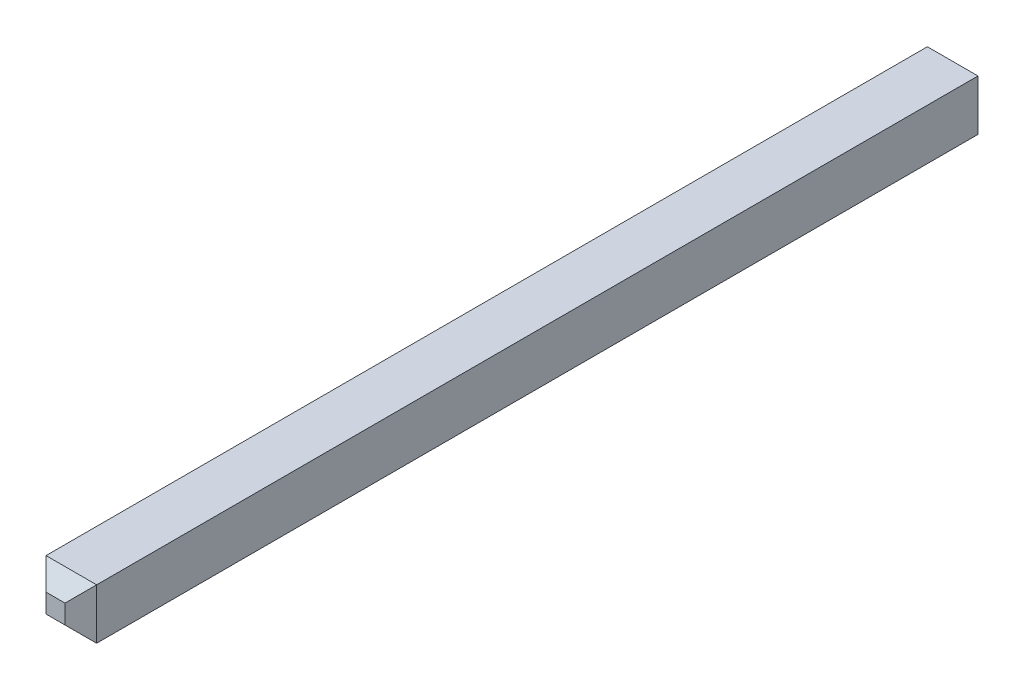
ISO-10303-21;
HEADER;
FILE_DESCRIPTION(('STEP AP214'),'2;1');
FILE_NAME('part.step','',(''),(''),'','','');
FILE_SCHEMA(('AUTOMOTIVE_DESIGN { 1 0 10303 214 1 1 1 1 }'));
ENDSEC;
DATA;
#1=APPLICATION_CONTEXT('core data for automotive mechanical design processes');
#2=APPLICATION_PROTOCOL_DEFINITION('international standard','automotive_design',2000,#1);
#3=PRODUCT_CONTEXT('',#1,'mechanical');
#4=PRODUCT('Part','Part','',(#3));
#5=PRODUCT_RELATED_PRODUCT_CATEGORY('part','',(#4));
#6=PRODUCT_DEFINITION_FORMATION('','',#4);
#7=PRODUCT_DEFINITION_CONTEXT('part definition',#1,'design');
#8=PRODUCT_DEFINITION('design','',#6,#7);
#9=PRODUCT_DEFINITION_SHAPE('','',#8);
#10=(LENGTH_UNIT() NAMED_UNIT(*) SI_UNIT(.MILLI.,.METRE.));
#11=(NAMED_UNIT(*) PLANE_ANGLE_UNIT() SI_UNIT($,.RADIAN.));
#12=(NAMED_UNIT(*) SI_UNIT($,.STERADIAN.) SOLID_ANGLE_UNIT());
#13=UNCERTAINTY_MEASURE_WITH_UNIT(LENGTH_MEASURE(1.E-05),#10,'distance_accuracy_value','');
#14=(GEOMETRIC_REPRESENTATION_CONTEXT(3) GLOBAL_UNCERTAINTY_ASSIGNED_CONTEXT((#13)) GLOBAL_UNIT_ASSIGNED_CONTEXT((#10,
#11,#12)) REPRESENTATION_CONTEXT('',''));
#15=CARTESIAN_POINT('',(0.,0.,0.));
#16=DIRECTION('',(0.,0.,1.));
#17=DIRECTION('',(1.,0.,0.));
#18=AXIS2_PLACEMENT_3D('',#15,#16,#17);
#19=CARTESIAN_POINT('',(-0.32,0.12,-5.77));
#20=DIRECTION('',(0.,-0.707106781186548,0.707106781186548));
#21=DIRECTION('',(0.,-0.707106781186548,-0.707106781186548));
#22=AXIS2_PLACEMENT_3D('',#19,#20,#21);
#23=PLANE('',#22);
#24=DIRECTION('',(1.,0.,0.));
#25=VECTOR('',#24,1.);
#26=CARTESIAN_POINT('',(-0.32,0.12,-5.77));
#27=LINE('',#26,#25);
#28=CARTESIAN_POINT('',(0.12,0.12,-5.77));
#29=VERTEX_POINT('',#28);
#30=CARTESIAN_POINT('',(-0.12,0.12,-5.77));
#31=VERTEX_POINT('',#30);
#32=EDGE_CURVE('E79',#29,#31,#27,.F.);
#33=ORIENTED_EDGE('',*,*,#32,.T.);
#34=DIRECTION('',(-0.577350269189626,0.577350269189626,0.577350269189625));
#35=VECTOR('',#34,1.);
#36=CARTESIAN_POINT('',(-0.12,0.12,-5.77));
#37=LINE('',#36,#35);
#38=CARTESIAN_POINT('',(-0.32,0.32,-5.57));
#39=VERTEX_POINT('',#38);
#40=EDGE_CURVE('E20',#31,#39,#37,.T.);
#41=ORIENTED_EDGE('',*,*,#40,.T.);
#42=DIRECTION('',(1.,0.,0.));
#43=VECTOR('',#42,1.);
#44=CARTESIAN_POINT('',(0.,0.32,-5.57));
#45=LINE('',#44,#43);
#46=CARTESIAN_POINT('',(0.32,0.319999999999999,-5.57));
#47=VERTEX_POINT('',#46);
#48=EDGE_CURVE('E100',#39,#47,#45,.T.);
#49=ORIENTED_EDGE('',*,*,#48,.T.);
#50=DIRECTION('',(-0.577350269189626,-0.577350269189626,-0.577350269189625));
#51=VECTOR('',#50,1.);
#52=CARTESIAN_POINT('',(0.32,0.32,-5.57));
#53=LINE('',#52,#51);
#54=EDGE_CURVE('E85',#47,#29,#53,.T.);
#55=ORIENTED_EDGE('',*,*,#54,.T.);
#56=EDGE_LOOP('',(#33,#41,#49,#55));
#57=FACE_BOUND('',#56,.T.);
#58=ADVANCED_FACE('F17',(#57),#23,.F.);
#59=CARTESIAN_POINT('',(0.32,0.12,5.77));
#60=DIRECTION('',(0.,-0.707106781186548,-0.707106781186548));
#61=DIRECTION('',(0.,0.707106781186548,-0.707106781186548));
#62=AXIS2_PLACEMENT_3D('',#59,#60,#61);
#63=PLANE('',#62);
#64=DIRECTION('',(1.,0.,0.));
#65=VECTOR('',#64,1.);
#66=CARTESIAN_POINT('',(0.,0.32,5.57));
#67=LINE('',#66,#65);
#68=CARTESIAN_POINT('',(0.32,0.32,5.57));
#69=VERTEX_POINT('',#68);
#70=CARTESIAN_POINT('',(-0.32,0.32,5.57));
#71=VERTEX_POINT('',#70);
#72=EDGE_CURVE('E98',#69,#71,#67,.F.);
#73=ORIENTED_EDGE('',*,*,#72,.T.);
#74=DIRECTION('',(0.577350269189626,-0.577350269189626,0.577350269189625));
#75=VECTOR('',#74,1.);
#76=CARTESIAN_POINT('',(-0.32,0.32,5.57));
#77=LINE('',#76,#75);
#78=CARTESIAN_POINT('',(-0.12,0.12,5.77));
#79=VERTEX_POINT('',#78);
#80=EDGE_CURVE('E107',#71,#79,#77,.T.);
#81=ORIENTED_EDGE('',*,*,#80,.T.);
#82=DIRECTION('',(-1.,0.,0.));
#83=VECTOR('',#82,1.);
#84=CARTESIAN_POINT('',(0.32,0.12,5.77));
#85=LINE('',#84,#83);
#86=CARTESIAN_POINT('',(0.12,0.12,5.77));
#87=VERTEX_POINT('',#86);
#88=EDGE_CURVE('E114',#79,#87,#85,.F.);
#89=ORIENTED_EDGE('',*,*,#88,.T.);
#90=DIRECTION('',(0.577350269189626,0.577350269189626,-0.577350269189625));
#91=VECTOR('',#90,1.);
#92=CARTESIAN_POINT('',(0.12,0.12,5.77));
#93=LINE('',#92,#91);
#94=EDGE_CURVE('E109',#87,#69,#93,.T.);
#95=ORIENTED_EDGE('',*,*,#94,.T.);
#96=EDGE_LOOP('',(#73,#81,#89,#95));
#97=FACE_BOUND('',#96,.T.);
#98=ADVANCED_FACE('F176',(#97),#63,.F.);
#99=CARTESIAN_POINT('',(-0.12,-0.32,-5.77));
#100=DIRECTION('',(0.707106781186548,0.,0.707106781186548));
#101=DIRECTION('',(0.707106781186548,0.,-0.707106781186548));
#102=AXIS2_PLACEMENT_3D('',#99,#100,#101);
#103=PLANE('',#102);
#104=DIRECTION('',(0.,1.,0.));
#105=VECTOR('',#104,1.);
#106=CARTESIAN_POINT('',(-0.12,-0.32,-5.77));
#107=LINE('',#106,#105);
#108=CARTESIAN_POINT('',(-0.12,-0.12,-5.77));
#109=VERTEX_POINT('',#108);
#110=EDGE_CURVE('E87',#31,#109,#107,.F.);
#111=ORIENTED_EDGE('',*,*,#110,.T.);
#112=DIRECTION('',(0.577350269189625,0.577350269189628,-0.577350269189624));
#113=VECTOR('',#112,1.);
#114=CARTESIAN_POINT('',(-0.32,-0.320000000000002,-5.57));
#115=LINE('',#114,#113);
#116=CARTESIAN_POINT('',(-0.32,-0.32,-5.57));
#117=VERTEX_POINT('',#116);
#118=EDGE_CURVE('E124',#117,#109,#115,.T.);
#119=ORIENTED_EDGE('',*,*,#118,.F.);
#120=DIRECTION('',(0.,1.,0.));
#121=VECTOR('',#120,1.);
#122=CARTESIAN_POINT('',(-0.320000000000001,-0.32,-5.57));
#123=LINE('',#122,#121);
#124=EDGE_CURVE('E92',#117,#39,#123,.T.);
#125=ORIENTED_EDGE('',*,*,#124,.T.);
#126=ORIENTED_EDGE('',*,*,#40,.F.);
#127=EDGE_LOOP('',(#111,#119,#125,#126));
#128=FACE_BOUND('',#127,.T.);
#129=ADVANCED_FACE('F89',(#128),#103,.F.);
#130=CARTESIAN_POINT('',(-0.32,-0.32,-5.77));
#131=DIRECTION('',(0.,0.,1.));
#132=DIRECTION('',(1.,0.,0.));
#133=AXIS2_PLACEMENT_3D('',#130,#131,#132);
#134=PLANE('',#133);
#135=DIRECTION('',(1.,0.,0.));
#136=VECTOR('',#135,1.);
#137=CARTESIAN_POINT('',(0.,-0.12,-5.77));
#138=LINE('',#137,#136);
#139=CARTESIAN_POINT('',(0.12,-0.12,-5.77));
#140=VERTEX_POINT('',#139);
#141=EDGE_CURVE('E96',#109,#140,#138,.T.);
#142=ORIENTED_EDGE('',*,*,#141,.F.);
#143=ORIENTED_EDGE('',*,*,#110,.F.);
#144=ORIENTED_EDGE('',*,*,#32,.F.);
#145=DIRECTION('',(0.,1.,0.));
#146=VECTOR('',#145,1.);
#147=CARTESIAN_POINT('',(0.12,-0.32,-5.77));
#148=LINE('',#147,#146);
#149=EDGE_CURVE('E104',#29,#140,#148,.F.);
#150=ORIENTED_EDGE('',*,*,#149,.T.);
#151=EDGE_LOOP('',(#142,#143,#144,#150));
#152=FACE_BOUND('',#151,.T.);
#153=ADVANCED_FACE('F94',(#152),#134,.F.);
#154=CARTESIAN_POINT('',(0.,0.32,0.));
#155=DIRECTION('',(0.,-1.,0.));
#156=DIRECTION('',(0.,0.,-1.));
#157=AXIS2_PLACEMENT_3D('',#154,#155,#156);
#158=PLANE('',#157);
#159=ORIENTED_EDGE('',*,*,#48,.F.);
#160=DIRECTION('',(0.,0.,-1.));
#161=VECTOR('',#160,1.);
#162=CARTESIAN_POINT('',(-0.32,0.32,5.77));
#163=LINE('',#162,#161);
#164=EDGE_CURVE('E121',#39,#71,#163,.F.);
#165=ORIENTED_EDGE('',*,*,#164,.T.);
#166=ORIENTED_EDGE('',*,*,#72,.F.);
#167=DIRECTION('',(0.,0.,1.));
#168=VECTOR('',#167,1.);
#169=CARTESIAN_POINT('',(0.32,0.32,-5.77));
#170=LINE('',#169,#168);
#171=EDGE_CURVE('E132',#69,#47,#170,.F.);
#172=ORIENTED_EDGE('',*,*,#171,.T.);
#173=EDGE_LOOP('',(#159,#165,#166,#172));
#174=FACE_BOUND('',#173,.T.);
#175=ADVANCED_FACE('F210',(#174),#158,.F.);
#176=CARTESIAN_POINT('',(0.32,-0.32,-5.57));
#177=DIRECTION('',(-0.707106781186548,0.,0.707106781186548));
#178=DIRECTION('',(0.707106781186548,0.,0.707106781186548));
#179=AXIS2_PLACEMENT_3D('',#176,#177,#178);
#180=PLANE('',#179);
#181=DIRECTION('',(0.,1.,0.));
#182=VECTOR('',#181,1.);
#183=CARTESIAN_POINT('',(0.32,-0.32,-5.57));
#184=LINE('',#183,#182);
#185=CARTESIAN_POINT('',(0.32,-0.32,-5.57));
#186=VERTEX_POINT('',#185);
#187=EDGE_CURVE('E135',#47,#186,#184,.F.);
#188=ORIENTED_EDGE('',*,*,#187,.T.);
#189=DIRECTION('',(0.577350269189627,-0.577350269189624,0.577350269189626));
#190=VECTOR('',#189,1.);
#191=CARTESIAN_POINT('',(0.12,-0.12,-5.77));
#192=LINE('',#191,#190);
#193=EDGE_CURVE('E127',#140,#186,#192,.T.);
#194=ORIENTED_EDGE('',*,*,#193,.F.);
#195=ORIENTED_EDGE('',*,*,#149,.F.);
#196=ORIENTED_EDGE('',*,*,#54,.F.);
#197=EDGE_LOOP('',(#188,#194,#195,#196));
#198=FACE_BOUND('',#197,.T.);
#199=ADVANCED_FACE('F187',(#198),#180,.F.);
#200=CARTESIAN_POINT('',(-0.32,-0.32,5.57));
#201=DIRECTION('',(0.707106781186548,0.,-0.707106781186548));
#202=DIRECTION('',(-0.707106781186548,0.,-0.707106781186548));
#203=AXIS2_PLACEMENT_3D('',#200,#201,#202);
#204=PLANE('',#203);
#205=DIRECTION('',(0.,1.,0.));
#206=VECTOR('',#205,1.);
#207=CARTESIAN_POINT('',(-0.12,-0.32,5.77));
#208=LINE('',#207,#206);
#209=CARTESIAN_POINT('',(-0.12,-0.12,5.77));
#210=VERTEX_POINT('',#209);
#211=EDGE_CURVE('E111',#210,#79,#208,.T.);
#212=ORIENTED_EDGE('',*,*,#211,.T.);
#213=ORIENTED_EDGE('',*,*,#80,.F.);
#214=DIRECTION('',(0.,1.,0.));
#215=VECTOR('',#214,1.);
#216=CARTESIAN_POINT('',(-0.32,-0.32,5.57));
#217=LINE('',#216,#215);
#218=CARTESIAN_POINT('',(-0.32,-0.32,5.57));
#219=VERTEX_POINT('',#218);
#220=EDGE_CURVE('E118',#71,#219,#217,.F.);
#221=ORIENTED_EDGE('',*,*,#220,.T.);
#222=DIRECTION('',(-0.577350269189627,-0.577350269189626,-0.577350269189625));
#223=VECTOR('',#222,1.);
#224=CARTESIAN_POINT('',(-0.12,-0.12,5.77));
#225=LINE('',#224,#223);
#226=EDGE_CURVE('E137',#210,#219,#225,.T.);
#227=ORIENTED_EDGE('',*,*,#226,.F.);
#228=EDGE_LOOP('',(#212,#213,#221,#227));
#229=FACE_BOUND('',#228,.T.);
#230=ADVANCED_FACE('F167',(#229),#204,.F.);
#231=CARTESIAN_POINT('',(0.12,-0.32,5.77));
#232=DIRECTION('',(-0.707106781186548,0.,-0.707106781186548));
#233=DIRECTION('',(-0.707106781186548,0.,0.707106781186548));
#234=AXIS2_PLACEMENT_3D('',#231,#232,#233);
#235=PLANE('',#234);
#236=DIRECTION('',(0.,1.,0.));
#237=VECTOR('',#236,1.);
#238=CARTESIAN_POINT('',(0.32,-0.32,5.57));
#239=LINE('',#238,#237);
#240=CARTESIAN_POINT('',(0.32,-0.32,5.57));
#241=VERTEX_POINT('',#240);
#242=EDGE_CURVE('E130',#241,#69,#239,.T.);
#243=ORIENTED_EDGE('',*,*,#242,.T.);
#244=ORIENTED_EDGE('',*,*,#94,.F.);
#245=DIRECTION('',(0.,1.,0.));
#246=VECTOR('',#245,1.);
#247=CARTESIAN_POINT('',(0.12,-0.32,5.77));
#248=LINE('',#247,#246);
#249=CARTESIAN_POINT('',(0.12,-0.12,5.77));
#250=VERTEX_POINT('',#249);
#251=EDGE_CURVE('E116',#87,#250,#248,.F.);
#252=ORIENTED_EDGE('',*,*,#251,.T.);
#253=DIRECTION('',(-0.577350269189627,0.577350269189626,0.577350269189625));
#254=VECTOR('',#253,1.);
#255=CARTESIAN_POINT('',(0.32,-0.32,5.57));
#256=LINE('',#255,#254);
#257=EDGE_CURVE('E35',#241,#250,#256,.T.);
#258=ORIENTED_EDGE('',*,*,#257,.F.);
#259=EDGE_LOOP('',(#243,#244,#252,#258));
#260=FACE_BOUND('',#259,.T.);
#261=ADVANCED_FACE('F177',(#260),#235,.F.);
#262=CARTESIAN_POINT('',(0.32,-0.32,5.77));
#263=DIRECTION('',(0.,0.,-1.));
#264=DIRECTION('',(-1.,0.,0.));
#265=AXIS2_PLACEMENT_3D('',#262,#263,#264);
#266=PLANE('',#265);
#267=ORIENTED_EDGE('',*,*,#88,.F.);
#268=ORIENTED_EDGE('',*,*,#211,.F.);
#269=DIRECTION('',(1.,0.,0.));
#270=VECTOR('',#269,1.);
#271=CARTESIAN_POINT('',(0.,-0.12,5.77));
#272=LINE('',#271,#270);
#273=EDGE_CURVE('E141',#250,#210,#272,.F.);
#274=ORIENTED_EDGE('',*,*,#273,.F.);
#275=ORIENTED_EDGE('',*,*,#251,.F.);
#276=EDGE_LOOP('',(#267,#268,#274,#275));
#277=FACE_BOUND('',#276,.T.);
#278=ADVANCED_FACE('F173',(#277),#266,.F.);
#279=CARTESIAN_POINT('',(-0.32,-0.32,5.77));
#280=DIRECTION('',(1.,0.,0.));
#281=DIRECTION('',(0.,0.,-1.));
#282=AXIS2_PLACEMENT_3D('',#279,#280,#281);
#283=PLANE('',#282);
#284=ORIENTED_EDGE('',*,*,#124,.F.);
#285=DIRECTION('',(0.,0.,-1.));
#286=VECTOR('',#285,1.);
#287=CARTESIAN_POINT('',(-0.32,-0.32,0.));
#288=LINE('',#287,#286);
#289=EDGE_CURVE('E144',#219,#117,#288,.T.);
#290=ORIENTED_EDGE('',*,*,#289,.F.);
#291=ORIENTED_EDGE('',*,*,#220,.F.);
#292=ORIENTED_EDGE('',*,*,#164,.F.);
#293=EDGE_LOOP('',(#284,#290,#291,#292));
#294=FACE_BOUND('',#293,.T.);
#295=ADVANCED_FACE('F185',(#294),#283,.F.);
#296=CARTESIAN_POINT('',(0.,-0.32,-5.57));
#297=DIRECTION('',(0.,-0.707106781186548,-0.707106781186548));
#298=DIRECTION('',(0.,0.707106781186548,-0.707106781186548));
#299=AXIS2_PLACEMENT_3D('',#296,#297,#298);
#300=PLANE('',#299);
#301=ORIENTED_EDGE('',*,*,#193,.T.);
#302=DIRECTION('',(1.,0.,0.));
#303=VECTOR('',#302,1.);
#304=CARTESIAN_POINT('',(0.,-0.32,-5.57));
#305=LINE('',#304,#303);
#306=EDGE_CURVE('E147',#117,#186,#305,.T.);
#307=ORIENTED_EDGE('',*,*,#306,.F.);
#308=ORIENTED_EDGE('',*,*,#118,.T.);
#309=ORIENTED_EDGE('',*,*,#141,.T.);
#310=EDGE_LOOP('',(#301,#307,#308,#309));
#311=FACE_BOUND('',#310,.T.);
#312=ADVANCED_FACE('F198',(#311),#300,.T.);
#313=CARTESIAN_POINT('',(0.32,-0.32,-5.77));
#314=DIRECTION('',(-1.,0.,0.));
#315=DIRECTION('',(0.,0.,1.));
#316=AXIS2_PLACEMENT_3D('',#313,#314,#315);
#317=PLANE('',#316);
#318=ORIENTED_EDGE('',*,*,#187,.F.);
#319=ORIENTED_EDGE('',*,*,#171,.F.);
#320=ORIENTED_EDGE('',*,*,#242,.F.);
#321=DIRECTION('',(0.,0.,-1.));
#322=VECTOR('',#321,1.);
#323=CARTESIAN_POINT('',(0.32,-0.32,0.));
#324=LINE('',#323,#322);
#325=EDGE_CURVE('E26',#186,#241,#324,.F.);
#326=ORIENTED_EDGE('',*,*,#325,.F.);
#327=EDGE_LOOP('',(#318,#319,#320,#326));
#328=FACE_BOUND('',#327,.T.);
#329=ADVANCED_FACE('F158',(#328),#317,.F.);
#330=CARTESIAN_POINT('',(0.,-0.32,5.57));
#331=DIRECTION('',(0.,-0.707106781186548,0.707106781186548));
#332=DIRECTION('',(0.,-0.707106781186548,-0.707106781186548));
#333=AXIS2_PLACEMENT_3D('',#330,#331,#332);
#334=PLANE('',#333);
#335=ORIENTED_EDGE('',*,*,#257,.T.);
#336=ORIENTED_EDGE('',*,*,#273,.T.);
#337=ORIENTED_EDGE('',*,*,#226,.T.);
#338=DIRECTION('',(1.,0.,0.));
#339=VECTOR('',#338,1.);
#340=CARTESIAN_POINT('',(0.,-0.32,5.57));
#341=LINE('',#340,#339);
#342=EDGE_CURVE('E11',#241,#219,#341,.F.);
#343=ORIENTED_EDGE('',*,*,#342,.F.);
#344=EDGE_LOOP('',(#335,#336,#337,#343));
#345=FACE_BOUND('',#344,.T.);
#346=ADVANCED_FACE('F163',(#345),#334,.T.);
#347=CARTESIAN_POINT('',(0.,-0.32,0.));
#348=DIRECTION('',(0.,-1.,0.));
#349=DIRECTION('',(0.,0.,-1.));
#350=AXIS2_PLACEMENT_3D('',#347,#348,#349);
#351=PLANE('',#350);
#352=ORIENTED_EDGE('',*,*,#325,.T.);
#353=ORIENTED_EDGE('',*,*,#342,.T.);
#354=ORIENTED_EDGE('',*,*,#289,.T.);
#355=ORIENTED_EDGE('',*,*,#306,.T.);
#356=EDGE_LOOP('',(#352,#353,#354,#355));
#357=FACE_BOUND('',#356,.T.);
#358=ADVANCED_FACE('F153',(#357),#351,.T.);
#359=CLOSED_SHELL('',(#58,#98,#129,#153,#175,#199,#230,#261,#278,#295,#312,#329,#346,#358));
#360=MANIFOLD_SOLID_BREP('B1',#359);
#361=ADVANCED_BREP_SHAPE_REPRESENTATION('',(#18,#360),#14);
#362=SHAPE_DEFINITION_REPRESENTATION(#9,#361);
ENDSEC;
END-ISO-10303-21;
